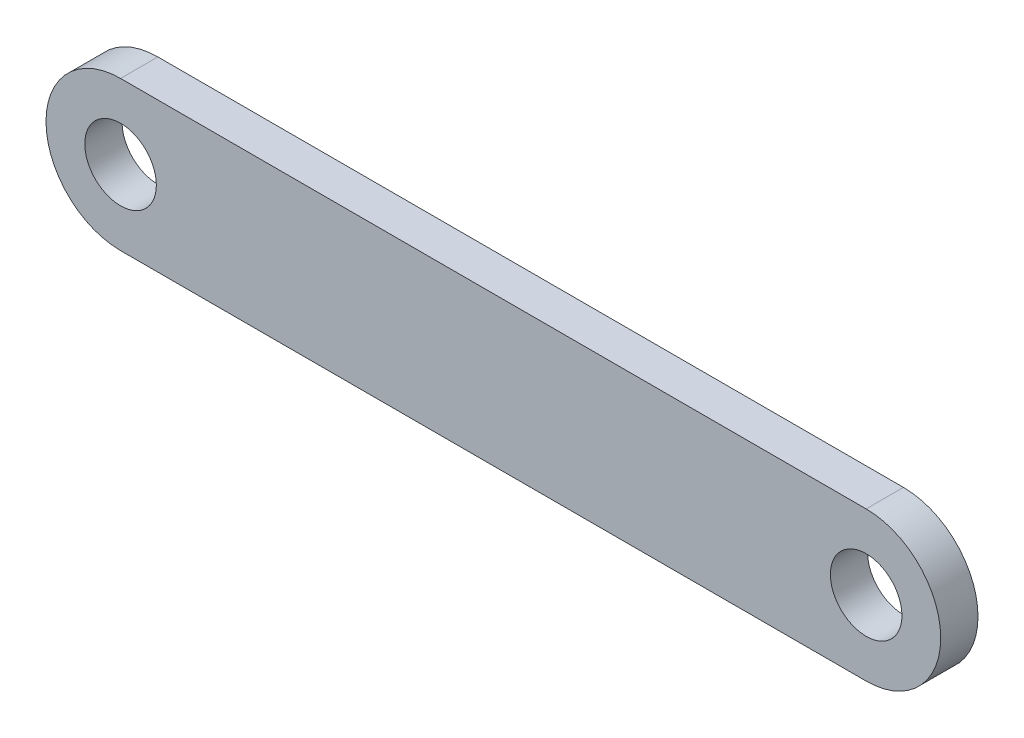
ISO-10303-21;
HEADER;
FILE_DESCRIPTION(('STEP AP214'),'2;1');
FILE_NAME('part.step','',(''),(''),'','','');
FILE_SCHEMA(('AUTOMOTIVE_DESIGN { 1 0 10303 214 1 1 1 1 }'));
ENDSEC;
DATA;
#1=APPLICATION_CONTEXT('core data for automotive mechanical design processes');
#2=APPLICATION_PROTOCOL_DEFINITION('international standard','automotive_design',2000,#1);
#3=PRODUCT_CONTEXT('',#1,'mechanical');
#4=PRODUCT('Part','Part','',(#3));
#5=PRODUCT_RELATED_PRODUCT_CATEGORY('part','',(#4));
#6=PRODUCT_DEFINITION_FORMATION('','',#4);
#7=PRODUCT_DEFINITION_CONTEXT('part definition',#1,'design');
#8=PRODUCT_DEFINITION('design','',#6,#7);
#9=PRODUCT_DEFINITION_SHAPE('','',#8);
#10=(LENGTH_UNIT() NAMED_UNIT(*) SI_UNIT(.MILLI.,.METRE.));
#11=(NAMED_UNIT(*) PLANE_ANGLE_UNIT() SI_UNIT($,.RADIAN.));
#12=(NAMED_UNIT(*) SI_UNIT($,.STERADIAN.) SOLID_ANGLE_UNIT());
#13=UNCERTAINTY_MEASURE_WITH_UNIT(LENGTH_MEASURE(1.E-05),#10,'distance_accuracy_value','');
#14=(GEOMETRIC_REPRESENTATION_CONTEXT(3) GLOBAL_UNCERTAINTY_ASSIGNED_CONTEXT((#13)) GLOBAL_UNIT_ASSIGNED_CONTEXT((#10,
#11,#12)) REPRESENTATION_CONTEXT('',''));
#15=CARTESIAN_POINT('',(0.,0.,0.));
#16=DIRECTION('',(0.,0.,1.));
#17=DIRECTION('',(1.,0.,0.));
#18=AXIS2_PLACEMENT_3D('',#15,#16,#17);
#19=CARTESIAN_POINT('',(31.7500000000001,0.,3.175));
#20=DIRECTION('',(0.,0.,1.));
#21=DIRECTION('',(1.,0.,0.));
#22=AXIS2_PLACEMENT_3D('',#19,#20,#21);
#23=PLANE('',#22);
#24=CARTESIAN_POINT('',(31.7500000000001,0.,3.175));
#25=DIRECTION('',(0.,0.,1.));
#26=DIRECTION('',(1.,0.,0.));
#27=AXIS2_PLACEMENT_3D('',#24,#25,#26);
#28=CIRCLE('',#27,3.048);
#29=CARTESIAN_POINT('',(34.7980000000001,0.,3.175));
#30=VERTEX_POINT('',#29);
#31=EDGE_CURVE('E101',#30,#30,#28,.T.);
#32=ORIENTED_EDGE('',*,*,#31,.F.);
#33=EDGE_LOOP('',(#32));
#34=FACE_BOUND('',#33,.T.);
#35=CARTESIAN_POINT('',(31.7500000000001,0.,3.175));
#36=DIRECTION('',(0.,0.,1.));
#37=DIRECTION('',(1.,0.,0.));
#38=AXIS2_PLACEMENT_3D('',#35,#36,#37);
#39=CIRCLE('',#38,6.35);
#40=CARTESIAN_POINT('',(31.7500000000001,-6.35,3.175));
#41=VERTEX_POINT('',#40);
#42=CARTESIAN_POINT('',(31.7500000000001,6.35000000000001,3.175));
#43=VERTEX_POINT('',#42);
#44=EDGE_CURVE('E86',#41,#43,#39,.T.);
#45=ORIENTED_EDGE('',*,*,#44,.T.);
#46=DIRECTION('',(-1.,0.,0.));
#47=VECTOR('',#46,1.);
#48=CARTESIAN_POINT('',(-31.75,6.35,3.175));
#49=LINE('',#48,#47);
#50=CARTESIAN_POINT('',(-31.75,6.35,3.175));
#51=VERTEX_POINT('',#50);
#52=EDGE_CURVE('E81',#43,#51,#49,.T.);
#53=ORIENTED_EDGE('',*,*,#52,.T.);
#54=CARTESIAN_POINT('',(-31.75,0.,3.175));
#55=DIRECTION('',(0.,0.,1.));
#56=DIRECTION('',(1.,0.,0.));
#57=AXIS2_PLACEMENT_3D('',#54,#55,#56);
#58=CIRCLE('',#57,6.35);
#59=CARTESIAN_POINT('',(-31.75,-6.35,3.175));
#60=VERTEX_POINT('',#59);
#61=EDGE_CURVE('E84',#51,#60,#58,.T.);
#62=ORIENTED_EDGE('',*,*,#61,.T.);
#63=DIRECTION('',(1.,0.,0.));
#64=VECTOR('',#63,1.);
#65=CARTESIAN_POINT('',(-31.75,-6.35,3.175));
#66=LINE('',#65,#64);
#67=EDGE_CURVE('E51',#60,#41,#66,.T.);
#68=ORIENTED_EDGE('',*,*,#67,.T.);
#69=EDGE_LOOP('',(#45,#53,#62,#68));
#70=FACE_BOUND('',#69,.T.);
#71=CARTESIAN_POINT('',(-31.75,0.,3.175));
#72=DIRECTION('',(0.,0.,1.));
#73=DIRECTION('',(1.,0.,0.));
#74=AXIS2_PLACEMENT_3D('',#71,#72,#73);
#75=CIRCLE('',#74,3.048);
#76=CARTESIAN_POINT('',(-28.702,0.,3.175));
#77=VERTEX_POINT('',#76);
#78=EDGE_CURVE('E116',#77,#77,#75,.T.);
#79=ORIENTED_EDGE('',*,*,#78,.F.);
#80=EDGE_LOOP('',(#79));
#81=FACE_BOUND('',#80,.T.);
#82=ADVANCED_FACE('F34',(#34,#70,#81),#23,.T.);
#83=CARTESIAN_POINT('',(31.7500000000001,0.,0.));
#84=DIRECTION('',(0.,0.,1.));
#85=DIRECTION('',(1.,0.,0.));
#86=AXIS2_PLACEMENT_3D('',#83,#84,#85);
#87=PLANE('',#86);
#88=CARTESIAN_POINT('',(31.7500000000001,0.,0.));
#89=DIRECTION('',(0.,0.,1.));
#90=DIRECTION('',(1.,0.,0.));
#91=AXIS2_PLACEMENT_3D('',#88,#89,#90);
#92=CIRCLE('',#91,6.35);
#93=CARTESIAN_POINT('',(31.7500000000001,-6.35,0.));
#94=VERTEX_POINT('',#93);
#95=CARTESIAN_POINT('',(31.7500000000001,6.35000000000001,0.));
#96=VERTEX_POINT('',#95);
#97=EDGE_CURVE('E98',#94,#96,#92,.T.);
#98=ORIENTED_EDGE('',*,*,#97,.F.);
#99=DIRECTION('',(1.,0.,0.));
#100=VECTOR('',#99,1.);
#101=CARTESIAN_POINT('',(-31.75,-6.35,0.));
#102=LINE('',#101,#100);
#103=CARTESIAN_POINT('',(-31.75,-6.35,0.));
#104=VERTEX_POINT('',#103);
#105=EDGE_CURVE('E74',#104,#94,#102,.T.);
#106=ORIENTED_EDGE('',*,*,#105,.F.);
#107=CARTESIAN_POINT('',(-31.75,0.,0.));
#108=DIRECTION('',(0.,0.,1.));
#109=DIRECTION('',(1.,0.,0.));
#110=AXIS2_PLACEMENT_3D('',#107,#108,#109);
#111=CIRCLE('',#110,6.35);
#112=CARTESIAN_POINT('',(-31.75,6.35,0.));
#113=VERTEX_POINT('',#112);
#114=EDGE_CURVE('E68',#113,#104,#111,.T.);
#115=ORIENTED_EDGE('',*,*,#114,.F.);
#116=DIRECTION('',(-1.,0.,0.));
#117=VECTOR('',#116,1.);
#118=CARTESIAN_POINT('',(-31.75,6.35,0.));
#119=LINE('',#118,#117);
#120=EDGE_CURVE('E90',#96,#113,#119,.T.);
#121=ORIENTED_EDGE('',*,*,#120,.F.);
#122=EDGE_LOOP('',(#98,#106,#115,#121));
#123=FACE_BOUND('',#122,.T.);
#124=CARTESIAN_POINT('',(31.7500000000001,0.,0.));
#125=DIRECTION('',(0.,0.,1.));
#126=DIRECTION('',(1.,0.,0.));
#127=AXIS2_PLACEMENT_3D('',#124,#125,#126);
#128=CIRCLE('',#127,3.048);
#129=CARTESIAN_POINT('',(34.7980000000001,0.,0.));
#130=VERTEX_POINT('',#129);
#131=EDGE_CURVE('E113',#130,#130,#128,.T.);
#132=ORIENTED_EDGE('',*,*,#131,.T.);
#133=EDGE_LOOP('',(#132));
#134=FACE_BOUND('',#133,.T.);
#135=CARTESIAN_POINT('',(-31.75,0.,0.));
#136=DIRECTION('',(0.,0.,1.));
#137=DIRECTION('',(1.,0.,0.));
#138=AXIS2_PLACEMENT_3D('',#135,#136,#137);
#139=CIRCLE('',#138,3.048);
#140=CARTESIAN_POINT('',(-28.702,0.,0.));
#141=VERTEX_POINT('',#140);
#142=EDGE_CURVE('E119',#141,#141,#139,.T.);
#143=ORIENTED_EDGE('',*,*,#142,.T.);
#144=EDGE_LOOP('',(#143));
#145=FACE_BOUND('',#144,.T.);
#146=ADVANCED_FACE('F109',(#123,#134,#145),#87,.F.);
#147=CARTESIAN_POINT('',(31.7500000000001,0.,3.175));
#148=DIRECTION('',(0.,0.,-1.));
#149=DIRECTION('',(-1.,0.,0.));
#150=AXIS2_PLACEMENT_3D('',#147,#148,#149);
#151=CYLINDRICAL_SURFACE('',#150,6.35);
#152=ORIENTED_EDGE('',*,*,#97,.T.);
#153=DIRECTION('',(0.,0.,-1.));
#154=VECTOR('',#153,1.);
#155=CARTESIAN_POINT('',(31.7500000000001,6.35000000000001,3.175));
#156=LINE('',#155,#154);
#157=EDGE_CURVE('E11',#43,#96,#156,.T.);
#158=ORIENTED_EDGE('',*,*,#157,.F.);
#159=ORIENTED_EDGE('',*,*,#44,.F.);
#160=DIRECTION('',(0.,0.,-1.));
#161=VECTOR('',#160,1.);
#162=CARTESIAN_POINT('',(31.7500000000001,-6.35,3.175));
#163=LINE('',#162,#161);
#164=EDGE_CURVE('E94',#41,#94,#163,.T.);
#165=ORIENTED_EDGE('',*,*,#164,.T.);
#166=EDGE_LOOP('',(#152,#158,#159,#165));
#167=FACE_BOUND('',#166,.T.);
#168=ADVANCED_FACE('F36',(#167),#151,.T.);
#169=CARTESIAN_POINT('',(-31.75,6.35,3.175));
#170=DIRECTION('',(0.,-1.,0.));
#171=DIRECTION('',(1.,0.,0.));
#172=AXIS2_PLACEMENT_3D('',#169,#170,#171);
#173=PLANE('',#172);
#174=ORIENTED_EDGE('',*,*,#120,.T.);
#175=DIRECTION('',(0.,0.,-1.));
#176=VECTOR('',#175,1.);
#177=CARTESIAN_POINT('',(-31.75,6.35,3.175));
#178=LINE('',#177,#176);
#179=EDGE_CURVE('E43',#51,#113,#178,.T.);
#180=ORIENTED_EDGE('',*,*,#179,.F.);
#181=ORIENTED_EDGE('',*,*,#52,.F.);
#182=ORIENTED_EDGE('',*,*,#157,.T.);
#183=EDGE_LOOP('',(#174,#180,#181,#182));
#184=FACE_BOUND('',#183,.T.);
#185=ADVANCED_FACE('F89',(#184),#173,.F.);
#186=CARTESIAN_POINT('',(-31.75,0.,3.175));
#187=DIRECTION('',(0.,0.,-1.));
#188=DIRECTION('',(-1.,0.,0.));
#189=AXIS2_PLACEMENT_3D('',#186,#187,#188);
#190=CYLINDRICAL_SURFACE('',#189,6.35);
#191=ORIENTED_EDGE('',*,*,#114,.T.);
#192=DIRECTION('',(0.,0.,-1.));
#193=VECTOR('',#192,1.);
#194=CARTESIAN_POINT('',(-31.75,-6.35,3.175));
#195=LINE('',#194,#193);
#196=EDGE_CURVE('E91',#60,#104,#195,.T.);
#197=ORIENTED_EDGE('',*,*,#196,.F.);
#198=ORIENTED_EDGE('',*,*,#61,.F.);
#199=ORIENTED_EDGE('',*,*,#179,.T.);
#200=EDGE_LOOP('',(#191,#197,#198,#199));
#201=FACE_BOUND('',#200,.T.);
#202=ADVANCED_FACE('F92',(#201),#190,.T.);
#203=CARTESIAN_POINT('',(-31.75,-6.35,3.175));
#204=DIRECTION('',(0.,1.,0.));
#205=DIRECTION('',(0.,0.,1.));
#206=AXIS2_PLACEMENT_3D('',#203,#204,#205);
#207=PLANE('',#206);
#208=ORIENTED_EDGE('',*,*,#105,.T.);
#209=ORIENTED_EDGE('',*,*,#164,.F.);
#210=ORIENTED_EDGE('',*,*,#67,.F.);
#211=ORIENTED_EDGE('',*,*,#196,.T.);
#212=EDGE_LOOP('',(#208,#209,#210,#211));
#213=FACE_BOUND('',#212,.T.);
#214=ADVANCED_FACE('F106',(#213),#207,.F.);
#215=CARTESIAN_POINT('',(31.7500000000001,0.,3.175));
#216=DIRECTION('',(0.,0.,-1.));
#217=DIRECTION('',(-1.,0.,0.));
#218=AXIS2_PLACEMENT_3D('',#215,#216,#217);
#219=CYLINDRICAL_SURFACE('',#218,3.048);
#220=ORIENTED_EDGE('',*,*,#31,.T.);
#221=EDGE_LOOP('',(#220));
#222=FACE_BOUND('',#221,.T.);
#223=ORIENTED_EDGE('',*,*,#131,.F.);
#224=EDGE_LOOP('',(#223));
#225=FACE_BOUND('',#224,.T.);
#226=ADVANCED_FACE('F136',(#222,#225),#219,.F.);
#227=CARTESIAN_POINT('',(-31.75,0.,3.175));
#228=DIRECTION('',(0.,0.,-1.));
#229=DIRECTION('',(-1.,0.,0.));
#230=AXIS2_PLACEMENT_3D('',#227,#228,#229);
#231=CYLINDRICAL_SURFACE('',#230,3.048);
#232=ORIENTED_EDGE('',*,*,#78,.T.);
#233=EDGE_LOOP('',(#232));
#234=FACE_BOUND('',#233,.T.);
#235=ORIENTED_EDGE('',*,*,#142,.F.);
#236=EDGE_LOOP('',(#235));
#237=FACE_BOUND('',#236,.T.);
#238=ADVANCED_FACE('F125',(#234,#237),#231,.F.);
#239=CLOSED_SHELL('',(#82,#146,#168,#185,#202,#214,#226,#238));
#240=MANIFOLD_SOLID_BREP('B2',#239);
#241=ADVANCED_BREP_SHAPE_REPRESENTATION('',(#18,#240),#14);
#242=SHAPE_DEFINITION_REPRESENTATION(#9,#241);
ENDSEC;
END-ISO-10303-21;
